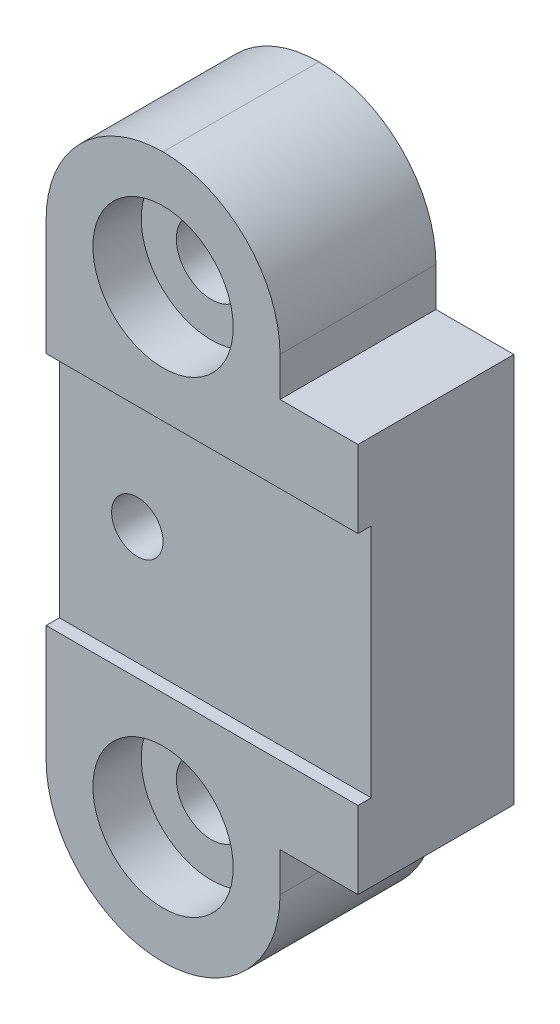
ISO-10303-21;
HEADER;
FILE_DESCRIPTION(('STEP AP214'),'2;1');
FILE_NAME('part.step','',(''),(''),'','','');
FILE_SCHEMA(('AUTOMOTIVE_DESIGN { 1 0 10303 214 1 1 1 1 }'));
ENDSEC;
DATA;
#1=APPLICATION_CONTEXT('core data for automotive mechanical design processes');
#2=APPLICATION_PROTOCOL_DEFINITION('international standard','automotive_design',2000,#1);
#3=PRODUCT_CONTEXT('',#1,'mechanical');
#4=PRODUCT('Part','Part','',(#3));
#5=PRODUCT_RELATED_PRODUCT_CATEGORY('part','',(#4));
#6=PRODUCT_DEFINITION_FORMATION('','',#4);
#7=PRODUCT_DEFINITION_CONTEXT('part definition',#1,'design');
#8=PRODUCT_DEFINITION('design','',#6,#7);
#9=PRODUCT_DEFINITION_SHAPE('','',#8);
#10=(LENGTH_UNIT() NAMED_UNIT(*) SI_UNIT(.MILLI.,.METRE.));
#11=(NAMED_UNIT(*) PLANE_ANGLE_UNIT() SI_UNIT($,.RADIAN.));
#12=(NAMED_UNIT(*) SI_UNIT($,.STERADIAN.) SOLID_ANGLE_UNIT());
#13=UNCERTAINTY_MEASURE_WITH_UNIT(LENGTH_MEASURE(1.E-05),#10,'distance_accuracy_value','');
#14=(GEOMETRIC_REPRESENTATION_CONTEXT(3) GLOBAL_UNCERTAINTY_ASSIGNED_CONTEXT((#13)) GLOBAL_UNIT_ASSIGNED_CONTEXT((#10,
#11,#12)) REPRESENTATION_CONTEXT('',''));
#15=CARTESIAN_POINT('',(0.,0.,0.));
#16=DIRECTION('',(0.,0.,1.));
#17=DIRECTION('',(1.,0.,0.));
#18=AXIS2_PLACEMENT_3D('',#15,#16,#17);
#19=CARTESIAN_POINT('',(0.,0.,10.));
#20=DIRECTION('',(0.,0.,-1.));
#21=DIRECTION('',(-1.,0.,0.));
#22=AXIS2_PLACEMENT_3D('',#19,#20,#21);
#23=PLANE('',#22);
#24=CARTESIAN_POINT('',(7.50000000000001,7.5,10.));
#25=DIRECTION('',(0.,0.,1.));
#26=DIRECTION('',(1.,0.,0.));
#27=AXIS2_PLACEMENT_3D('',#24,#25,#26);
#28=CIRCLE('',#27,4.5);
#29=CARTESIAN_POINT('',(12.,7.5,10.));
#30=VERTEX_POINT('',#29);
#31=EDGE_CURVE('E337',#30,#30,#28,.T.);
#32=ORIENTED_EDGE('',*,*,#31,.F.);
#33=EDGE_LOOP('',(#32));
#34=FACE_BOUND('',#33,.T.);
#35=DIRECTION('',(0.,-1.,0.));
#36=VECTOR('',#35,1.);
#37=CARTESIAN_POINT('',(0.,0.,10.));
#38=LINE('',#37,#36);
#39=CARTESIAN_POINT('',(0.,14.95,10.));
#40=VERTEX_POINT('',#39);
#41=CARTESIAN_POINT('',(0.,7.49999999999999,10.));
#42=VERTEX_POINT('',#41);
#43=EDGE_CURVE('E182',#40,#42,#38,.T.);
#44=ORIENTED_EDGE('',*,*,#43,.T.);
#45=CARTESIAN_POINT('',(7.5,7.5,10.));
#46=DIRECTION('',(0.,0.,-1.));
#47=DIRECTION('',(-1.,0.,0.));
#48=AXIS2_PLACEMENT_3D('',#45,#46,#47);
#49=CIRCLE('',#48,7.5);
#50=CARTESIAN_POINT('',(7.50000000000001,0.,10.));
#51=VERTEX_POINT('',#50);
#52=EDGE_CURVE('E226',#42,#51,#49,.F.);
#53=ORIENTED_EDGE('',*,*,#52,.T.);
#54=CARTESIAN_POINT('',(7.50000000000001,7.5,10.));
#55=DIRECTION('',(0.,0.,-1.));
#56=DIRECTION('',(-1.,0.,0.));
#57=AXIS2_PLACEMENT_3D('',#54,#55,#56);
#58=CIRCLE('',#57,7.5);
#59=CARTESIAN_POINT('',(15.,7.5,10.));
#60=VERTEX_POINT('',#59);
#61=EDGE_CURVE('E224',#51,#60,#58,.F.);
#62=ORIENTED_EDGE('',*,*,#61,.T.);
#63=DIRECTION('',(0.,1.,0.));
#64=VECTOR('',#63,1.);
#65=CARTESIAN_POINT('',(15.,9.99999999999999,10.));
#66=LINE('',#65,#64);
#67=CARTESIAN_POINT('',(15.,9.99999999999999,10.));
#68=VERTEX_POINT('',#67);
#69=EDGE_CURVE('E170',#60,#68,#66,.T.);
#70=ORIENTED_EDGE('',*,*,#69,.T.);
#71=DIRECTION('',(1.,0.,0.));
#72=VECTOR('',#71,1.);
#73=CARTESIAN_POINT('',(20.,10.,10.));
#74=LINE('',#73,#72);
#75=CARTESIAN_POINT('',(20.,10.,10.));
#76=VERTEX_POINT('',#75);
#77=EDGE_CURVE('E172',#68,#76,#74,.T.);
#78=ORIENTED_EDGE('',*,*,#77,.T.);
#79=DIRECTION('',(0.,1.,0.));
#80=VECTOR('',#79,1.);
#81=CARTESIAN_POINT('',(20.,35.,10.));
#82=LINE('',#81,#80);
#83=CARTESIAN_POINT('',(20.,14.95,10.));
#84=VERTEX_POINT('',#83);
#85=EDGE_CURVE('E175',#76,#84,#82,.T.);
#86=ORIENTED_EDGE('',*,*,#85,.T.);
#87=DIRECTION('',(1.,0.,0.));
#88=VECTOR('',#87,1.);
#89=CARTESIAN_POINT('',(20.,14.95,10.));
#90=LINE('',#89,#88);
#91=EDGE_CURVE('E158',#40,#84,#90,.T.);
#92=ORIENTED_EDGE('',*,*,#91,.F.);
#93=EDGE_LOOP('',(#44,#53,#62,#70,#78,#86,#92));
#94=FACE_BOUND('',#93,.T.);
#95=ADVANCED_FACE('F37',(#34,#94),#23,.F.);
#96=CARTESIAN_POINT('',(15.,9.99999999999999,10.));
#97=DIRECTION('',(-1.,0.,0.));
#98=DIRECTION('',(0.,-1.,0.));
#99=AXIS2_PLACEMENT_3D('',#96,#97,#98);
#100=PLANE('',#99);
#101=ORIENTED_EDGE('',*,*,#69,.F.);
#102=DIRECTION('',(0.,0.,-1.));
#103=VECTOR('',#102,1.);
#104=CARTESIAN_POINT('',(15.,7.5,10.));
#105=LINE('',#104,#103);
#106=CARTESIAN_POINT('',(15.,7.5,0.));
#107=VERTEX_POINT('',#106);
#108=EDGE_CURVE('E228',#60,#107,#105,.T.);
#109=ORIENTED_EDGE('',*,*,#108,.T.);
#110=DIRECTION('',(0.,1.,0.));
#111=VECTOR('',#110,1.);
#112=CARTESIAN_POINT('',(15.,9.99999999999999,0.));
#113=LINE('',#112,#111);
#114=CARTESIAN_POINT('',(15.,9.99999999999999,0.));
#115=VERTEX_POINT('',#114);
#116=EDGE_CURVE('E186',#107,#115,#113,.T.);
#117=ORIENTED_EDGE('',*,*,#116,.T.);
#118=DIRECTION('',(0.,0.,-1.));
#119=VECTOR('',#118,1.);
#120=CARTESIAN_POINT('',(15.,9.99999999999999,10.));
#121=LINE('',#120,#119);
#122=EDGE_CURVE('E208',#68,#115,#121,.T.);
#123=ORIENTED_EDGE('',*,*,#122,.F.);
#124=EDGE_LOOP('',(#101,#109,#117,#123));
#125=FACE_BOUND('',#124,.T.);
#126=ADVANCED_FACE('F276',(#125),#100,.F.);
#127=CARTESIAN_POINT('',(20.,10.,10.));
#128=DIRECTION('',(0.,1.,0.));
#129=DIRECTION('',(-1.,0.,0.));
#130=AXIS2_PLACEMENT_3D('',#127,#128,#129);
#131=PLANE('',#130);
#132=DIRECTION('',(1.,0.,0.));
#133=VECTOR('',#132,1.);
#134=CARTESIAN_POINT('',(20.,10.,0.));
#135=LINE('',#134,#133);
#136=CARTESIAN_POINT('',(20.,10.,0.));
#137=VERTEX_POINT('',#136);
#138=EDGE_CURVE('E188',#115,#137,#135,.T.);
#139=ORIENTED_EDGE('',*,*,#138,.T.);
#140=DIRECTION('',(0.,0.,-1.));
#141=VECTOR('',#140,1.);
#142=CARTESIAN_POINT('',(20.,10.,10.));
#143=LINE('',#142,#141);
#144=EDGE_CURVE('E205',#76,#137,#143,.T.);
#145=ORIENTED_EDGE('',*,*,#144,.F.);
#146=ORIENTED_EDGE('',*,*,#77,.F.);
#147=ORIENTED_EDGE('',*,*,#122,.T.);
#148=EDGE_LOOP('',(#139,#145,#146,#147));
#149=FACE_BOUND('',#148,.T.);
#150=ADVANCED_FACE('F285',(#149),#131,.F.);
#151=CARTESIAN_POINT('',(20.,35.,10.));
#152=DIRECTION('',(-1.,0.,0.));
#153=DIRECTION('',(0.,-1.,0.));
#154=AXIS2_PLACEMENT_3D('',#151,#152,#153);
#155=PLANE('',#154);
#156=DIRECTION('',(0.,1.,0.));
#157=VECTOR('',#156,1.);
#158=CARTESIAN_POINT('',(20.,14.95,9.15));
#159=LINE('',#158,#157);
#160=CARTESIAN_POINT('',(20.,14.95,9.15));
#161=VERTEX_POINT('',#160);
#162=CARTESIAN_POINT('',(20.,30.05,9.15));
#163=VERTEX_POINT('',#162);
#164=EDGE_CURVE('E149',#161,#163,#159,.T.);
#165=ORIENTED_EDGE('',*,*,#164,.F.);
#166=DIRECTION('',(0.,0.,1.));
#167=VECTOR('',#166,1.);
#168=CARTESIAN_POINT('',(20.,14.95,9.15));
#169=LINE('',#168,#167);
#170=EDGE_CURVE('E189',#161,#84,#169,.T.);
#171=ORIENTED_EDGE('',*,*,#170,.T.);
#172=ORIENTED_EDGE('',*,*,#85,.F.);
#173=ORIENTED_EDGE('',*,*,#144,.T.);
#174=DIRECTION('',(0.,1.,0.));
#175=VECTOR('',#174,1.);
#176=CARTESIAN_POINT('',(20.,35.,0.));
#177=LINE('',#176,#175);
#178=CARTESIAN_POINT('',(20.,35.,0.));
#179=VERTEX_POINT('',#178);
#180=EDGE_CURVE('E191',#137,#179,#177,.T.);
#181=ORIENTED_EDGE('',*,*,#180,.T.);
#182=DIRECTION('',(0.,0.,-1.));
#183=VECTOR('',#182,1.);
#184=CARTESIAN_POINT('',(20.,35.,10.));
#185=LINE('',#184,#183);
#186=CARTESIAN_POINT('',(20.,35.,10.));
#187=VERTEX_POINT('',#186);
#188=EDGE_CURVE('E202',#187,#179,#185,.T.);
#189=ORIENTED_EDGE('',*,*,#188,.F.);
#190=CARTESIAN_POINT('',(20.,30.05,10.));
#191=VERTEX_POINT('',#190);
#192=EDGE_CURVE('E163',#191,#187,#82,.T.);
#193=ORIENTED_EDGE('',*,*,#192,.F.);
#194=DIRECTION('',(0.,0.,1.));
#195=VECTOR('',#194,1.);
#196=CARTESIAN_POINT('',(20.,30.05,9.15));
#197=LINE('',#196,#195);
#198=EDGE_CURVE('E142',#163,#191,#197,.T.);
#199=ORIENTED_EDGE('',*,*,#198,.F.);
#200=EDGE_LOOP('',(#165,#171,#172,#173,#181,#189,#193,#199));
#201=FACE_BOUND('',#200,.T.);
#202=ADVANCED_FACE('F161',(#201),#155,.F.);
#203=CARTESIAN_POINT('',(15.,35.,10.));
#204=DIRECTION('',(0.,-1.,0.));
#205=DIRECTION('',(0.,0.,-1.));
#206=AXIS2_PLACEMENT_3D('',#203,#204,#205);
#207=PLANE('',#206);
#208=DIRECTION('',(-1.,0.,0.));
#209=VECTOR('',#208,1.);
#210=CARTESIAN_POINT('',(15.,35.,0.));
#211=LINE('',#210,#209);
#212=CARTESIAN_POINT('',(15.,35.,0.));
#213=VERTEX_POINT('',#212);
#214=EDGE_CURVE('E193',#179,#213,#211,.T.);
#215=ORIENTED_EDGE('',*,*,#214,.T.);
#216=DIRECTION('',(0.,0.,-1.));
#217=VECTOR('',#216,1.);
#218=CARTESIAN_POINT('',(15.,35.,10.));
#219=LINE('',#218,#217);
#220=CARTESIAN_POINT('',(15.,35.,10.));
#221=VERTEX_POINT('',#220);
#222=EDGE_CURVE('E185',#221,#213,#219,.T.);
#223=ORIENTED_EDGE('',*,*,#222,.F.);
#224=DIRECTION('',(-1.,0.,0.));
#225=VECTOR('',#224,1.);
#226=CARTESIAN_POINT('',(15.,35.,10.));
#227=LINE('',#226,#225);
#228=EDGE_CURVE('E178',#187,#221,#227,.T.);
#229=ORIENTED_EDGE('',*,*,#228,.F.);
#230=ORIENTED_EDGE('',*,*,#188,.T.);
#231=EDGE_LOOP('',(#215,#223,#229,#230));
#232=FACE_BOUND('',#231,.T.);
#233=ADVANCED_FACE('F289',(#232),#207,.F.);
#234=CARTESIAN_POINT('',(15.,45.,10.));
#235=DIRECTION('',(-1.,0.,0.));
#236=DIRECTION('',(0.,0.,1.));
#237=AXIS2_PLACEMENT_3D('',#234,#235,#236);
#238=PLANE('',#237);
#239=DIRECTION('',(0.,1.,0.));
#240=VECTOR('',#239,1.);
#241=CARTESIAN_POINT('',(15.,45.,0.));
#242=LINE('',#241,#240);
#243=CARTESIAN_POINT('',(15.,37.5,0.));
#244=VERTEX_POINT('',#243);
#245=EDGE_CURVE('E195',#213,#244,#242,.T.);
#246=ORIENTED_EDGE('',*,*,#245,.T.);
#247=DIRECTION('',(0.,0.,-1.));
#248=VECTOR('',#247,1.);
#249=CARTESIAN_POINT('',(15.,37.5,10.));
#250=LINE('',#249,#248);
#251=CARTESIAN_POINT('',(15.,37.5,10.));
#252=VERTEX_POINT('',#251);
#253=EDGE_CURVE('E230',#244,#252,#250,.F.);
#254=ORIENTED_EDGE('',*,*,#253,.T.);
#255=DIRECTION('',(0.,1.,0.));
#256=VECTOR('',#255,1.);
#257=CARTESIAN_POINT('',(15.,45.,10.));
#258=LINE('',#257,#256);
#259=EDGE_CURVE('E180',#221,#252,#258,.T.);
#260=ORIENTED_EDGE('',*,*,#259,.F.);
#261=ORIENTED_EDGE('',*,*,#222,.T.);
#262=EDGE_LOOP('',(#246,#254,#260,#261));
#263=FACE_BOUND('',#262,.T.);
#264=ADVANCED_FACE('F293',(#263),#238,.F.);
#265=CARTESIAN_POINT('',(0.,0.,10.));
#266=DIRECTION('',(1.,0.,0.));
#267=DIRECTION('',(0.,1.,0.));
#268=AXIS2_PLACEMENT_3D('',#265,#266,#267);
#269=PLANE('',#268);
#270=DIRECTION('',(0.,-1.,0.));
#271=VECTOR('',#270,1.);
#272=CARTESIAN_POINT('',(0.,0.,0.));
#273=LINE('',#272,#271);
#274=CARTESIAN_POINT('',(0.,37.5,0.));
#275=VERTEX_POINT('',#274);
#276=CARTESIAN_POINT('',(0.,7.49999999999999,0.));
#277=VERTEX_POINT('',#276);
#278=EDGE_CURVE('E173',#275,#277,#273,.T.);
#279=ORIENTED_EDGE('',*,*,#278,.T.);
#280=DIRECTION('',(0.,0.,-1.));
#281=VECTOR('',#280,1.);
#282=CARTESIAN_POINT('',(0.,7.5,10.));
#283=LINE('',#282,#281);
#284=EDGE_CURVE('E221',#277,#42,#283,.F.);
#285=ORIENTED_EDGE('',*,*,#284,.T.);
#286=ORIENTED_EDGE('',*,*,#43,.F.);
#287=DIRECTION('',(0.,0.,1.));
#288=VECTOR('',#287,1.);
#289=CARTESIAN_POINT('',(0.,14.95,9.15));
#290=LINE('',#289,#288);
#291=CARTESIAN_POINT('',(0.,14.95,9.15));
#292=VERTEX_POINT('',#291);
#293=EDGE_CURVE('E165',#292,#40,#290,.T.);
#294=ORIENTED_EDGE('',*,*,#293,.F.);
#295=DIRECTION('',(0.,-1.,0.));
#296=VECTOR('',#295,1.);
#297=CARTESIAN_POINT('',(0.,14.95,9.15));
#298=LINE('',#297,#296);
#299=CARTESIAN_POINT('',(0.,30.05,9.15));
#300=VERTEX_POINT('',#299);
#301=EDGE_CURVE('E148',#300,#292,#298,.T.);
#302=ORIENTED_EDGE('',*,*,#301,.F.);
#303=DIRECTION('',(0.,0.,1.));
#304=VECTOR('',#303,1.);
#305=CARTESIAN_POINT('',(0.,30.05,9.15));
#306=LINE('',#305,#304);
#307=CARTESIAN_POINT('',(0.,30.05,10.));
#308=VERTEX_POINT('',#307);
#309=EDGE_CURVE('E145',#300,#308,#306,.T.);
#310=ORIENTED_EDGE('',*,*,#309,.T.);
#311=CARTESIAN_POINT('',(0.,37.5,10.));
#312=VERTEX_POINT('',#311);
#313=EDGE_CURVE('E183',#312,#308,#38,.T.);
#314=ORIENTED_EDGE('',*,*,#313,.F.);
#315=DIRECTION('',(0.,0.,-1.));
#316=VECTOR('',#315,1.);
#317=CARTESIAN_POINT('',(0.,37.5,10.));
#318=LINE('',#317,#316);
#319=EDGE_CURVE('E219',#312,#275,#318,.T.);
#320=ORIENTED_EDGE('',*,*,#319,.T.);
#321=EDGE_LOOP('',(#279,#285,#286,#294,#302,#310,#314,#320));
#322=FACE_BOUND('',#321,.T.);
#323=ADVANCED_FACE('F250',(#322),#269,.F.);
#324=CARTESIAN_POINT('',(7.5,37.5,10.));
#325=DIRECTION('',(0.,0.,1.));
#326=DIRECTION('',(1.,0.,0.));
#327=AXIS2_PLACEMENT_3D('',#324,#325,#326);
#328=CIRCLE('',#327,4.5);
#329=CARTESIAN_POINT('',(12.,37.5,10.));
#330=VERTEX_POINT('',#329);
#331=EDGE_CURVE('E322',#330,#330,#328,.T.);
#332=ORIENTED_EDGE('',*,*,#331,.F.);
#333=EDGE_LOOP('',(#332));
#334=FACE_BOUND('',#333,.T.);
#335=ORIENTED_EDGE('',*,*,#259,.T.);
#336=CARTESIAN_POINT('',(7.50000000000001,37.5,10.));
#337=DIRECTION('',(0.,0.,-1.));
#338=DIRECTION('',(-1.,0.,0.));
#339=AXIS2_PLACEMENT_3D('',#336,#337,#338);
#340=CIRCLE('',#339,7.5);
#341=CARTESIAN_POINT('',(7.5,45.,10.));
#342=VERTEX_POINT('',#341);
#343=EDGE_CURVE('E11',#252,#342,#340,.F.);
#344=ORIENTED_EDGE('',*,*,#343,.T.);
#345=CARTESIAN_POINT('',(7.5,37.5,10.));
#346=DIRECTION('',(0.,0.,-1.));
#347=DIRECTION('',(-1.,0.,0.));
#348=AXIS2_PLACEMENT_3D('',#345,#346,#347);
#349=CIRCLE('',#348,7.5);
#350=EDGE_CURVE('E46',#342,#312,#349,.F.);
#351=ORIENTED_EDGE('',*,*,#350,.T.);
#352=ORIENTED_EDGE('',*,*,#313,.T.);
#353=DIRECTION('',(-1.,0.,0.));
#354=VECTOR('',#353,1.);
#355=CARTESIAN_POINT('',(20.,30.05,10.));
#356=LINE('',#355,#354);
#357=EDGE_CURVE('E256',#191,#308,#356,.T.);
#358=ORIENTED_EDGE('',*,*,#357,.F.);
#359=ORIENTED_EDGE('',*,*,#192,.T.);
#360=ORIENTED_EDGE('',*,*,#228,.T.);
#361=EDGE_LOOP('',(#335,#344,#351,#352,#358,#359,#360));
#362=FACE_BOUND('',#361,.T.);
#363=ADVANCED_FACE('F248',(#334,#362),#23,.F.);
#364=CARTESIAN_POINT('',(0.,0.,0.));
#365=DIRECTION('',(0.,0.,-1.));
#366=DIRECTION('',(-1.,0.,0.));
#367=AXIS2_PLACEMENT_3D('',#364,#365,#366);
#368=PLANE('',#367);
#369=CARTESIAN_POINT('',(5.,22.5,0.));
#370=DIRECTION('',(0.,0.,1.));
#371=DIRECTION('',(1.,0.,0.));
#372=AXIS2_PLACEMENT_3D('',#369,#370,#371);
#373=CIRCLE('',#372,1.65);
#374=CARTESIAN_POINT('',(6.65,22.5,0.));
#375=VERTEX_POINT('',#374);
#376=EDGE_CURVE('E239',#375,#375,#373,.T.);
#377=ORIENTED_EDGE('',*,*,#376,.T.);
#378=EDGE_LOOP('',(#377));
#379=FACE_BOUND('',#378,.T.);
#380=CARTESIAN_POINT('',(7.5,37.5,0.));
#381=DIRECTION('',(0.,0.,1.));
#382=DIRECTION('',(1.,0.,0.));
#383=AXIS2_PLACEMENT_3D('',#380,#381,#382);
#384=CIRCLE('',#383,2.25);
#385=CARTESIAN_POINT('',(9.75,37.5,0.));
#386=VERTEX_POINT('',#385);
#387=EDGE_CURVE('E334',#386,#386,#384,.T.);
#388=ORIENTED_EDGE('',*,*,#387,.T.);
#389=EDGE_LOOP('',(#388));
#390=FACE_BOUND('',#389,.T.);
#391=CARTESIAN_POINT('',(7.50000000000001,7.5,0.));
#392=DIRECTION('',(0.,0.,1.));
#393=DIRECTION('',(1.,0.,0.));
#394=AXIS2_PLACEMENT_3D('',#391,#392,#393);
#395=CIRCLE('',#394,2.25);
#396=CARTESIAN_POINT('',(9.75000000000001,7.5,0.));
#397=VERTEX_POINT('',#396);
#398=EDGE_CURVE('E258',#397,#397,#395,.T.);
#399=ORIENTED_EDGE('',*,*,#398,.T.);
#400=EDGE_LOOP('',(#399));
#401=FACE_BOUND('',#400,.T.);
#402=CARTESIAN_POINT('',(7.50000000000001,7.5,0.));
#403=DIRECTION('',(0.,0.,-1.));
#404=DIRECTION('',(-1.,0.,0.));
#405=AXIS2_PLACEMENT_3D('',#402,#403,#404);
#406=CIRCLE('',#405,7.5);
#407=CARTESIAN_POINT('',(7.50000000000001,0.,0.));
#408=VERTEX_POINT('',#407);
#409=EDGE_CURVE('E215',#107,#408,#406,.T.);
#410=ORIENTED_EDGE('',*,*,#409,.T.);
#411=CARTESIAN_POINT('',(7.5,7.5,0.));
#412=DIRECTION('',(0.,0.,-1.));
#413=DIRECTION('',(-1.,0.,0.));
#414=AXIS2_PLACEMENT_3D('',#411,#412,#413);
#415=CIRCLE('',#414,7.5);
#416=EDGE_CURVE('E217',#408,#277,#415,.T.);
#417=ORIENTED_EDGE('',*,*,#416,.T.);
#418=ORIENTED_EDGE('',*,*,#278,.F.);
#419=CARTESIAN_POINT('',(7.5,37.5,0.));
#420=DIRECTION('',(0.,0.,-1.));
#421=DIRECTION('',(-1.,0.,0.));
#422=AXIS2_PLACEMENT_3D('',#419,#420,#421);
#423=CIRCLE('',#422,7.5);
#424=CARTESIAN_POINT('',(7.5,45.,0.));
#425=VERTEX_POINT('',#424);
#426=EDGE_CURVE('E211',#275,#425,#423,.T.);
#427=ORIENTED_EDGE('',*,*,#426,.T.);
#428=CARTESIAN_POINT('',(7.50000000000001,37.5,0.));
#429=DIRECTION('',(0.,0.,-1.));
#430=DIRECTION('',(-1.,0.,0.));
#431=AXIS2_PLACEMENT_3D('',#428,#429,#430);
#432=CIRCLE('',#431,7.5);
#433=EDGE_CURVE('E213',#425,#244,#432,.T.);
#434=ORIENTED_EDGE('',*,*,#433,.T.);
#435=ORIENTED_EDGE('',*,*,#245,.F.);
#436=ORIENTED_EDGE('',*,*,#214,.F.);
#437=ORIENTED_EDGE('',*,*,#180,.F.);
#438=ORIENTED_EDGE('',*,*,#138,.F.);
#439=ORIENTED_EDGE('',*,*,#116,.F.);
#440=EDGE_LOOP('',(#410,#417,#418,#427,#434,#435,#436,#437,#438,#439));
#441=FACE_BOUND('',#440,.T.);
#442=ADVANCED_FACE('F280',(#379,#390,#401,#441),#368,.T.);
#443=CARTESIAN_POINT('',(20.,14.95,9.15));
#444=DIRECTION('',(0.,-1.,0.));
#445=DIRECTION('',(1.,0.,0.));
#446=AXIS2_PLACEMENT_3D('',#443,#444,#445);
#447=PLANE('',#446);
#448=ORIENTED_EDGE('',*,*,#91,.T.);
#449=ORIENTED_EDGE('',*,*,#170,.F.);
#450=DIRECTION('',(1.,0.,0.));
#451=VECTOR('',#450,1.);
#452=CARTESIAN_POINT('',(20.,14.95,9.15));
#453=LINE('',#452,#451);
#454=EDGE_CURVE('E155',#292,#161,#453,.T.);
#455=ORIENTED_EDGE('',*,*,#454,.F.);
#456=ORIENTED_EDGE('',*,*,#293,.T.);
#457=EDGE_LOOP('',(#448,#449,#455,#456));
#458=FACE_BOUND('',#457,.T.);
#459=ADVANCED_FACE('F262',(#458),#447,.F.);
#460=CARTESIAN_POINT('',(20.,30.05,9.15));
#461=DIRECTION('',(0.,1.,0.));
#462=DIRECTION('',(-1.,0.,0.));
#463=AXIS2_PLACEMENT_3D('',#460,#461,#462);
#464=PLANE('',#463);
#465=ORIENTED_EDGE('',*,*,#357,.T.);
#466=ORIENTED_EDGE('',*,*,#309,.F.);
#467=DIRECTION('',(-1.,0.,0.));
#468=VECTOR('',#467,1.);
#469=CARTESIAN_POINT('',(20.,30.05,9.15));
#470=LINE('',#469,#468);
#471=EDGE_CURVE('E137',#163,#300,#470,.T.);
#472=ORIENTED_EDGE('',*,*,#471,.F.);
#473=ORIENTED_EDGE('',*,*,#198,.T.);
#474=EDGE_LOOP('',(#465,#466,#472,#473));
#475=FACE_BOUND('',#474,.T.);
#476=ADVANCED_FACE('F140',(#475),#464,.F.);
#477=CARTESIAN_POINT('',(0.,0.,9.15));
#478=DIRECTION('',(0.,0.,1.));
#479=DIRECTION('',(1.,0.,0.));
#480=AXIS2_PLACEMENT_3D('',#477,#478,#479);
#481=PLANE('',#480);
#482=CARTESIAN_POINT('',(5.,22.5,9.15));
#483=DIRECTION('',(0.,0.,1.));
#484=DIRECTION('',(1.,0.,0.));
#485=AXIS2_PLACEMENT_3D('',#482,#483,#484);
#486=CIRCLE('',#485,1.65);
#487=CARTESIAN_POINT('',(6.65,22.5,9.15));
#488=VERTEX_POINT('',#487);
#489=EDGE_CURVE('E234',#488,#488,#486,.T.);
#490=ORIENTED_EDGE('',*,*,#489,.F.);
#491=EDGE_LOOP('',(#490));
#492=FACE_BOUND('',#491,.T.);
#493=ORIENTED_EDGE('',*,*,#164,.T.);
#494=ORIENTED_EDGE('',*,*,#471,.T.);
#495=ORIENTED_EDGE('',*,*,#301,.T.);
#496=ORIENTED_EDGE('',*,*,#454,.T.);
#497=EDGE_LOOP('',(#493,#494,#495,#496));
#498=FACE_BOUND('',#497,.T.);
#499=ADVANCED_FACE('F153',(#492,#498),#481,.T.);
#500=CARTESIAN_POINT('',(7.50000000000001,7.5,10.));
#501=DIRECTION('',(0.,0.,1.));
#502=DIRECTION('',(1.,0.,0.));
#503=AXIS2_PLACEMENT_3D('',#500,#501,#502);
#504=CYLINDRICAL_SURFACE('',#503,2.25);
#505=ORIENTED_EDGE('',*,*,#398,.F.);
#506=EDGE_LOOP('',(#505));
#507=FACE_BOUND('',#506,.T.);
#508=CARTESIAN_POINT('',(7.50000000000001,7.5,6.9));
#509=DIRECTION('',(0.,0.,1.));
#510=DIRECTION('',(1.,0.,0.));
#511=AXIS2_PLACEMENT_3D('',#508,#509,#510);
#512=CIRCLE('',#511,2.25);
#513=CARTESIAN_POINT('',(9.75000000000001,7.5,6.9));
#514=VERTEX_POINT('',#513);
#515=EDGE_CURVE('E343',#514,#514,#512,.T.);
#516=ORIENTED_EDGE('',*,*,#515,.T.);
#517=EDGE_LOOP('',(#516));
#518=FACE_BOUND('',#517,.T.);
#519=ADVANCED_FACE('F350',(#507,#518),#504,.F.);
#520=CARTESIAN_POINT('',(9.75000000000001,7.5,6.9));
#521=DIRECTION('',(0.,0.,-1.));
#522=DIRECTION('',(-1.,0.,0.));
#523=AXIS2_PLACEMENT_3D('',#520,#521,#522);
#524=PLANE('',#523);
#525=ORIENTED_EDGE('',*,*,#515,.F.);
#526=EDGE_LOOP('',(#525));
#527=FACE_BOUND('',#526,.T.);
#528=CARTESIAN_POINT('',(7.50000000000001,7.5,6.9));
#529=DIRECTION('',(0.,0.,1.));
#530=DIRECTION('',(1.,0.,0.));
#531=AXIS2_PLACEMENT_3D('',#528,#529,#530);
#532=CIRCLE('',#531,4.5);
#533=CARTESIAN_POINT('',(12.,7.5,6.9));
#534=VERTEX_POINT('',#533);
#535=EDGE_CURVE('E340',#534,#534,#532,.T.);
#536=ORIENTED_EDGE('',*,*,#535,.T.);
#537=EDGE_LOOP('',(#536));
#538=FACE_BOUND('',#537,.T.);
#539=ADVANCED_FACE('F353',(#527,#538),#524,.F.);
#540=CARTESIAN_POINT('',(7.50000000000001,7.5,10.));
#541=DIRECTION('',(0.,0.,1.));
#542=DIRECTION('',(1.,0.,0.));
#543=AXIS2_PLACEMENT_3D('',#540,#541,#542);
#544=CYLINDRICAL_SURFACE('',#543,4.5);
#545=ORIENTED_EDGE('',*,*,#535,.F.);
#546=EDGE_LOOP('',(#545));
#547=FACE_BOUND('',#546,.T.);
#548=ORIENTED_EDGE('',*,*,#31,.T.);
#549=EDGE_LOOP('',(#548));
#550=FACE_BOUND('',#549,.T.);
#551=ADVANCED_FACE('F359',(#547,#550),#544,.F.);
#552=CARTESIAN_POINT('',(7.5,37.5,10.));
#553=DIRECTION('',(0.,0.,1.));
#554=DIRECTION('',(1.,0.,0.));
#555=AXIS2_PLACEMENT_3D('',#552,#553,#554);
#556=CYLINDRICAL_SURFACE('',#555,2.25);
#557=ORIENTED_EDGE('',*,*,#387,.F.);
#558=EDGE_LOOP('',(#557));
#559=FACE_BOUND('',#558,.T.);
#560=CARTESIAN_POINT('',(7.5,37.5,6.9));
#561=DIRECTION('',(0.,0.,1.));
#562=DIRECTION('',(1.,0.,0.));
#563=AXIS2_PLACEMENT_3D('',#560,#561,#562);
#564=CIRCLE('',#563,2.25);
#565=CARTESIAN_POINT('',(9.75,37.5,6.9));
#566=VERTEX_POINT('',#565);
#567=EDGE_CURVE('E327',#566,#566,#564,.T.);
#568=ORIENTED_EDGE('',*,*,#567,.T.);
#569=EDGE_LOOP('',(#568));
#570=FACE_BOUND('',#569,.T.);
#571=ADVANCED_FACE('F365',(#559,#570),#556,.F.);
#572=CARTESIAN_POINT('',(9.75,37.5,6.9));
#573=DIRECTION('',(0.,0.,-1.));
#574=DIRECTION('',(-1.,0.,0.));
#575=AXIS2_PLACEMENT_3D('',#572,#573,#574);
#576=PLANE('',#575);
#577=ORIENTED_EDGE('',*,*,#567,.F.);
#578=EDGE_LOOP('',(#577));
#579=FACE_BOUND('',#578,.T.);
#580=CARTESIAN_POINT('',(7.5,37.5,6.9));
#581=DIRECTION('',(0.,0.,1.));
#582=DIRECTION('',(1.,0.,0.));
#583=AXIS2_PLACEMENT_3D('',#580,#581,#582);
#584=CIRCLE('',#583,4.5);
#585=CARTESIAN_POINT('',(12.,37.5,6.9));
#586=VERTEX_POINT('',#585);
#587=EDGE_CURVE('E324',#586,#586,#584,.T.);
#588=ORIENTED_EDGE('',*,*,#587,.T.);
#589=EDGE_LOOP('',(#588));
#590=FACE_BOUND('',#589,.T.);
#591=ADVANCED_FACE('F370',(#579,#590),#576,.F.);
#592=CARTESIAN_POINT('',(7.5,37.5,10.));
#593=DIRECTION('',(0.,0.,1.));
#594=DIRECTION('',(1.,0.,0.));
#595=AXIS2_PLACEMENT_3D('',#592,#593,#594);
#596=CYLINDRICAL_SURFACE('',#595,4.5);
#597=ORIENTED_EDGE('',*,*,#587,.F.);
#598=EDGE_LOOP('',(#597));
#599=FACE_BOUND('',#598,.T.);
#600=ORIENTED_EDGE('',*,*,#331,.T.);
#601=EDGE_LOOP('',(#600));
#602=FACE_BOUND('',#601,.T.);
#603=ADVANCED_FACE('F419',(#599,#602),#596,.F.);
#604=CARTESIAN_POINT('',(5.,22.5,9.15));
#605=DIRECTION('',(0.,0.,1.));
#606=DIRECTION('',(1.,0.,0.));
#607=AXIS2_PLACEMENT_3D('',#604,#605,#606);
#608=CYLINDRICAL_SURFACE('',#607,1.65);
#609=ORIENTED_EDGE('',*,*,#376,.F.);
#610=EDGE_LOOP('',(#609));
#611=FACE_BOUND('',#610,.T.);
#612=ORIENTED_EDGE('',*,*,#489,.T.);
#613=EDGE_LOOP('',(#612));
#614=FACE_BOUND('',#613,.T.);
#615=ADVANCED_FACE('F427',(#611,#614),#608,.F.);
#616=CARTESIAN_POINT('',(7.50000000000001,7.5,10.));
#617=DIRECTION('',(0.,0.,-1.));
#618=DIRECTION('',(-1.,0.,0.));
#619=AXIS2_PLACEMENT_3D('',#616,#617,#618);
#620=CYLINDRICAL_SURFACE('',#619,7.5);
#621=ORIENTED_EDGE('',*,*,#108,.F.);
#622=ORIENTED_EDGE('',*,*,#61,.F.);
#623=DIRECTION('',(0.,0.,-1.));
#624=VECTOR('',#623,1.);
#625=CARTESIAN_POINT('',(7.50000000000001,0.,10.));
#626=LINE('',#625,#624);
#627=EDGE_CURVE('E232',#408,#51,#626,.F.);
#628=ORIENTED_EDGE('',*,*,#627,.F.);
#629=ORIENTED_EDGE('',*,*,#409,.F.);
#630=EDGE_LOOP('',(#621,#622,#628,#629));
#631=FACE_BOUND('',#630,.T.);
#632=ADVANCED_FACE('F272',(#631),#620,.T.);
#633=CARTESIAN_POINT('',(7.5,7.5,10.));
#634=DIRECTION('',(0.,0.,-1.));
#635=DIRECTION('',(-1.,0.,0.));
#636=AXIS2_PLACEMENT_3D('',#633,#634,#635);
#637=CYLINDRICAL_SURFACE('',#636,7.5);
#638=ORIENTED_EDGE('',*,*,#52,.F.);
#639=ORIENTED_EDGE('',*,*,#284,.F.);
#640=ORIENTED_EDGE('',*,*,#416,.F.);
#641=ORIENTED_EDGE('',*,*,#627,.T.);
#642=EDGE_LOOP('',(#638,#639,#640,#641));
#643=FACE_BOUND('',#642,.T.);
#644=ADVANCED_FACE('F267',(#643),#637,.T.);
#645=CARTESIAN_POINT('',(7.5,37.5,10.));
#646=DIRECTION('',(0.,0.,-1.));
#647=DIRECTION('',(-1.,0.,0.));
#648=AXIS2_PLACEMENT_3D('',#645,#646,#647);
#649=CYLINDRICAL_SURFACE('',#648,7.5);
#650=ORIENTED_EDGE('',*,*,#319,.F.);
#651=ORIENTED_EDGE('',*,*,#350,.F.);
#652=DIRECTION('',(0.,0.,-1.));
#653=VECTOR('',#652,1.);
#654=CARTESIAN_POINT('',(7.5,45.,10.));
#655=LINE('',#654,#653);
#656=EDGE_CURVE('E41',#425,#342,#655,.F.);
#657=ORIENTED_EDGE('',*,*,#656,.F.);
#658=ORIENTED_EDGE('',*,*,#426,.F.);
#659=EDGE_LOOP('',(#650,#651,#657,#658));
#660=FACE_BOUND('',#659,.T.);
#661=ADVANCED_FACE('F39',(#660),#649,.T.);
#662=CARTESIAN_POINT('',(7.50000000000001,37.5,10.));
#663=DIRECTION('',(0.,0.,-1.));
#664=DIRECTION('',(-1.,0.,0.));
#665=AXIS2_PLACEMENT_3D('',#662,#663,#664);
#666=CYLINDRICAL_SURFACE('',#665,7.5);
#667=ORIENTED_EDGE('',*,*,#343,.F.);
#668=ORIENTED_EDGE('',*,*,#253,.F.);
#669=ORIENTED_EDGE('',*,*,#433,.F.);
#670=ORIENTED_EDGE('',*,*,#656,.T.);
#671=EDGE_LOOP('',(#667,#668,#669,#670));
#672=FACE_BOUND('',#671,.T.);
#673=ADVANCED_FACE('F243',(#672),#666,.T.);
#674=CLOSED_SHELL('',(#95,#126,#150,#202,#233,#264,#323,#363,#442,#459,#476,#499,#519,#539,#551,
#571,#591,#603,#615,#632,#644,#661,#673));
#675=MANIFOLD_SOLID_BREP('B2',#674);
#676=ADVANCED_BREP_SHAPE_REPRESENTATION('',(#18,#675),#14);
#677=SHAPE_DEFINITION_REPRESENTATION(#9,#676);
ENDSEC;
END-ISO-10303-21;
